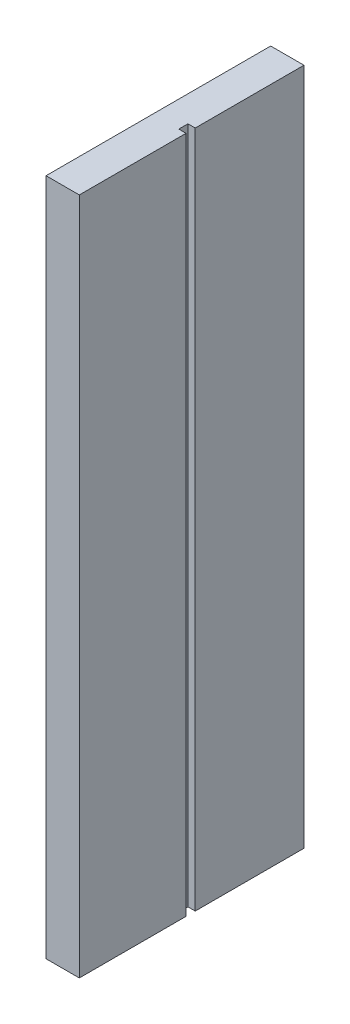
ISO-10303-21;
HEADER;
FILE_DESCRIPTION(('STEP AP214'),'2;1');
FILE_NAME('part.step','',(''),(''),'','','');
FILE_SCHEMA(('AUTOMOTIVE_DESIGN { 1 0 10303 214 1 1 1 1 }'));
ENDSEC;
DATA;
#1=APPLICATION_CONTEXT('core data for automotive mechanical design processes');
#2=APPLICATION_PROTOCOL_DEFINITION('international standard','automotive_design',2000,#1);
#3=PRODUCT_CONTEXT('',#1,'mechanical');
#4=PRODUCT('Part','Part','',(#3));
#5=PRODUCT_RELATED_PRODUCT_CATEGORY('part','',(#4));
#6=PRODUCT_DEFINITION_FORMATION('','',#4);
#7=PRODUCT_DEFINITION_CONTEXT('part definition',#1,'design');
#8=PRODUCT_DEFINITION('design','',#6,#7);
#9=PRODUCT_DEFINITION_SHAPE('','',#8);
#10=(LENGTH_UNIT() NAMED_UNIT(*) SI_UNIT(.MILLI.,.METRE.));
#11=(NAMED_UNIT(*) PLANE_ANGLE_UNIT() SI_UNIT($,.RADIAN.));
#12=(NAMED_UNIT(*) SI_UNIT($,.STERADIAN.) SOLID_ANGLE_UNIT());
#13=UNCERTAINTY_MEASURE_WITH_UNIT(LENGTH_MEASURE(1.E-05),#10,'distance_accuracy_value','');
#14=(GEOMETRIC_REPRESENTATION_CONTEXT(3) GLOBAL_UNCERTAINTY_ASSIGNED_CONTEXT((#13)) GLOBAL_UNIT_ASSIGNED_CONTEXT((#10,
#11,#12)) REPRESENTATION_CONTEXT('',''));
#15=CARTESIAN_POINT('',(0.,0.,0.));
#16=DIRECTION('',(0.,0.,1.));
#17=DIRECTION('',(1.,0.,0.));
#18=AXIS2_PLACEMENT_3D('',#15,#16,#17);
#19=CARTESIAN_POINT('',(0.,-163.,0.));
#20=DIRECTION('',(0.,0.,-1.));
#21=DIRECTION('',(-1.,0.,0.));
#22=AXIS2_PLACEMENT_3D('',#19,#20,#21);
#23=PLANE('',#22);
#24=DIRECTION('',(0.,1.,0.));
#25=VECTOR('',#24,1.);
#26=CARTESIAN_POINT('',(-3.94922764807326,-145.313996313571,0.));
#27=LINE('',#26,#25);
#28=CARTESIAN_POINT('',(-3.94922764807326,-145.313996313571,0.));
#29=VERTEX_POINT('',#28);
#30=CARTESIAN_POINT('',(-3.94922764807326,-140.865918785011,0.));
#31=VERTEX_POINT('',#30);
#32=EDGE_CURVE('E48',#29,#31,#27,.T.);
#33=ORIENTED_EDGE('',*,*,#32,.T.);
#34=DIRECTION('',(1.,0.,0.));
#35=VECTOR('',#34,1.);
#36=CARTESIAN_POINT('',(-8.00000000000001,-140.865918785011,0.));
#37=LINE('',#36,#35);
#38=CARTESIAN_POINT('',(-8.00000000000001,-140.865918785011,0.));
#39=VERTEX_POINT('',#38);
#40=EDGE_CURVE('E186',#39,#31,#37,.T.);
#41=ORIENTED_EDGE('',*,*,#40,.F.);
#42=DIRECTION('',(0.,1.,0.));
#43=VECTOR('',#42,1.);
#44=CARTESIAN_POINT('',(-8.00000000000001,-163.,0.));
#45=LINE('',#44,#43);
#46=CARTESIAN_POINT('',(-8.00000000000001,-91.0881127357461,0.));
#47=VERTEX_POINT('',#46);
#48=EDGE_CURVE('E309',#39,#47,#45,.T.);
#49=ORIENTED_EDGE('',*,*,#48,.T.);
#50=DIRECTION('',(1.,0.,0.));
#51=VECTOR('',#50,1.);
#52=CARTESIAN_POINT('',(-8.00000000000001,-91.0881127357461,0.));
#53=LINE('',#52,#51);
#54=CARTESIAN_POINT('',(-3.55888909966548,-91.0881127357461,0.));
#55=VERTEX_POINT('',#54);
#56=EDGE_CURVE('E209',#47,#55,#53,.T.);
#57=ORIENTED_EDGE('',*,*,#56,.T.);
#58=DIRECTION('',(0.,1.,0.));
#59=VECTOR('',#58,1.);
#60=CARTESIAN_POINT('',(-3.55888909966548,-91.0881127357461,0.));
#61=LINE('',#60,#59);
#62=CARTESIAN_POINT('',(-3.55888909966548,-86.9298687458269,0.));
#63=VERTEX_POINT('',#62);
#64=EDGE_CURVE('E220',#55,#63,#61,.T.);
#65=ORIENTED_EDGE('',*,*,#64,.T.);
#66=DIRECTION('',(1.,0.,0.));
#67=VECTOR('',#66,1.);
#68=CARTESIAN_POINT('',(-8.00000000000001,-86.9298687458269,0.));
#69=LINE('',#68,#67);
#70=CARTESIAN_POINT('',(-8.00000000000001,-86.9298687458269,0.));
#71=VERTEX_POINT('',#70);
#72=EDGE_CURVE('E188',#71,#63,#69,.T.);
#73=ORIENTED_EDGE('',*,*,#72,.F.);
#74=CARTESIAN_POINT('',(-8.00000000000001,-22.9429483674224,0.));
#75=VERTEX_POINT('',#74);
#76=EDGE_CURVE('E356',#71,#75,#45,.T.);
#77=ORIENTED_EDGE('',*,*,#76,.T.);
#78=DIRECTION('',(-1.,0.,0.));
#79=VECTOR('',#78,1.);
#80=CARTESIAN_POINT('',(-8.00000000000001,-22.9429483674224,0.));
#81=LINE('',#80,#79);
#82=CARTESIAN_POINT('',(-3.91515546333565,-22.9429483674224,0.));
#83=VERTEX_POINT('',#82);
#84=EDGE_CURVE('E239',#83,#75,#81,.T.);
#85=ORIENTED_EDGE('',*,*,#84,.F.);
#86=DIRECTION('',(0.,-1.,0.));
#87=VECTOR('',#86,1.);
#88=CARTESIAN_POINT('',(-3.91515546333565,-22.9429483674224,0.));
#89=LINE('',#88,#87);
#90=CARTESIAN_POINT('',(-3.91515546333565,-18.9850937317786,0.));
#91=VERTEX_POINT('',#90);
#92=EDGE_CURVE('E248',#91,#83,#89,.T.);
#93=ORIENTED_EDGE('',*,*,#92,.F.);
#94=DIRECTION('',(1.,0.,0.));
#95=VECTOR('',#94,1.);
#96=CARTESIAN_POINT('',(-8.00000000000001,-18.9850937317786,0.));
#97=LINE('',#96,#95);
#98=CARTESIAN_POINT('',(-8.00000000000001,-18.9850937317786,0.));
#99=VERTEX_POINT('',#98);
#100=EDGE_CURVE('E234',#99,#91,#97,.T.);
#101=ORIENTED_EDGE('',*,*,#100,.F.);
#102=CARTESIAN_POINT('',(-8.00000000000001,0.,0.));
#103=VERTEX_POINT('',#102);
#104=EDGE_CURVE('E305',#99,#103,#45,.T.);
#105=ORIENTED_EDGE('',*,*,#104,.T.);
#106=DIRECTION('',(-1.,0.,0.));
#107=VECTOR('',#106,1.);
#108=CARTESIAN_POINT('',(0.,0.,0.));
#109=LINE('',#108,#107);
#110=CARTESIAN_POINT('',(0.,0.,0.));
#111=VERTEX_POINT('',#110);
#112=EDGE_CURVE('E269',#111,#103,#109,.T.);
#113=ORIENTED_EDGE('',*,*,#112,.F.);
#114=DIRECTION('',(0.,1.,0.));
#115=VECTOR('',#114,1.);
#116=CARTESIAN_POINT('',(0.,-163.,0.));
#117=LINE('',#116,#115);
#118=CARTESIAN_POINT('',(0.,-163.,0.));
#119=VERTEX_POINT('',#118);
#120=EDGE_CURVE('E285',#119,#111,#117,.T.);
#121=ORIENTED_EDGE('',*,*,#120,.F.);
#122=DIRECTION('',(-1.,0.,0.));
#123=VECTOR('',#122,1.);
#124=CARTESIAN_POINT('',(0.,-163.,0.));
#125=LINE('',#124,#123);
#126=CARTESIAN_POINT('',(-8.00000000000001,-163.,0.));
#127=VERTEX_POINT('',#126);
#128=EDGE_CURVE('E282',#119,#127,#125,.T.);
#129=ORIENTED_EDGE('',*,*,#128,.T.);
#130=CARTESIAN_POINT('',(-8.00000000000001,-145.313996313571,0.));
#131=VERTEX_POINT('',#130);
#132=EDGE_CURVE('E306',#127,#131,#45,.T.);
#133=ORIENTED_EDGE('',*,*,#132,.T.);
#134=DIRECTION('',(1.,0.,0.));
#135=VECTOR('',#134,1.);
#136=CARTESIAN_POINT('',(-8.00000000000001,-145.313996313571,0.));
#137=LINE('',#136,#135);
#138=EDGE_CURVE('E53',#131,#29,#137,.T.);
#139=ORIENTED_EDGE('',*,*,#138,.T.);
#140=EDGE_LOOP('',(#33,#41,#49,#57,#65,#73,#77,#85,#93,#101,#105,#113,#121,#129,#133,#139));
#141=FACE_BOUND('',#140,.T.);
#142=ADVANCED_FACE('F33',(#141),#23,.T.);
#143=CARTESIAN_POINT('',(0.,-163.,0.));
#144=DIRECTION('',(-1.,0.,0.));
#145=DIRECTION('',(0.,0.,1.));
#146=AXIS2_PLACEMENT_3D('',#143,#144,#145);
#147=PLANE('',#146);
#148=DIRECTION('',(0.,0.,1.));
#149=VECTOR('',#148,1.);
#150=CARTESIAN_POINT('',(0.,0.,0.));
#151=LINE('',#150,#149);
#152=CARTESIAN_POINT('',(0.,0.,26.1414434986591));
#153=VERTEX_POINT('',#152);
#154=EDGE_CURVE('E264',#111,#153,#151,.T.);
#155=ORIENTED_EDGE('',*,*,#154,.T.);
#156=DIRECTION('',(0.,1.,0.));
#157=VECTOR('',#156,1.);
#158=CARTESIAN_POINT('',(0.,-163.,26.1414434986591));
#159=LINE('',#158,#157);
#160=CARTESIAN_POINT('',(0.,-163.,26.1414434986591));
#161=VERTEX_POINT('',#160);
#162=EDGE_CURVE('E11',#161,#153,#159,.T.);
#163=ORIENTED_EDGE('',*,*,#162,.F.);
#164=DIRECTION('',(0.,0.,1.));
#165=VECTOR('',#164,1.);
#166=CARTESIAN_POINT('',(0.,-163.,0.));
#167=LINE('',#166,#165);
#168=EDGE_CURVE('E265',#119,#161,#167,.T.);
#169=ORIENTED_EDGE('',*,*,#168,.F.);
#170=ORIENTED_EDGE('',*,*,#120,.T.);
#171=EDGE_LOOP('',(#155,#163,#169,#170));
#172=FACE_BOUND('',#171,.T.);
#173=ADVANCED_FACE('F35',(#172),#147,.F.);
#174=CARTESIAN_POINT('',(0.,-163.,26.1414434986591));
#175=DIRECTION('',(0.,0.,-1.));
#176=DIRECTION('',(-1.,0.,0.));
#177=AXIS2_PLACEMENT_3D('',#174,#175,#176);
#178=PLANE('',#177);
#179=DIRECTION('',(-1.,0.,0.));
#180=VECTOR('',#179,1.);
#181=CARTESIAN_POINT('',(0.,0.,26.1414434986591));
#182=LINE('',#181,#180);
#183=CARTESIAN_POINT('',(-1.74869007334344,0.,26.1414434986591));
#184=VERTEX_POINT('',#183);
#185=EDGE_CURVE('E288',#153,#184,#182,.T.);
#186=ORIENTED_EDGE('',*,*,#185,.T.);
#187=DIRECTION('',(0.,1.,0.));
#188=VECTOR('',#187,1.);
#189=CARTESIAN_POINT('',(-1.74869007334344,-163.,26.1414434986591));
#190=LINE('',#189,#188);
#191=CARTESIAN_POINT('',(-1.74869007334344,-163.,26.1414434986591));
#192=VERTEX_POINT('',#191);
#193=EDGE_CURVE('E41',#192,#184,#190,.T.);
#194=ORIENTED_EDGE('',*,*,#193,.F.);
#195=DIRECTION('',(-1.,0.,0.));
#196=VECTOR('',#195,1.);
#197=CARTESIAN_POINT('',(0.,-163.,26.1414434986591));
#198=LINE('',#197,#196);
#199=EDGE_CURVE('E268',#161,#192,#198,.T.);
#200=ORIENTED_EDGE('',*,*,#199,.F.);
#201=ORIENTED_EDGE('',*,*,#162,.T.);
#202=EDGE_LOOP('',(#186,#194,#200,#201));
#203=FACE_BOUND('',#202,.T.);
#204=ADVANCED_FACE('F349',(#203),#178,.F.);
#205=CARTESIAN_POINT('',(-1.74869007334344,-163.,26.1414434986591));
#206=DIRECTION('',(-1.,0.,0.));
#207=DIRECTION('',(0.,0.,1.));
#208=AXIS2_PLACEMENT_3D('',#205,#206,#207);
#209=PLANE('',#208);
#210=DIRECTION('',(0.,0.,1.));
#211=VECTOR('',#210,1.);
#212=CARTESIAN_POINT('',(-1.74869007334344,0.,26.1414434986591));
#213=LINE('',#212,#211);
#214=CARTESIAN_POINT('',(-1.74869007334344,0.,28.3423878615849));
#215=VERTEX_POINT('',#214);
#216=EDGE_CURVE('E290',#184,#215,#213,.T.);
#217=ORIENTED_EDGE('',*,*,#216,.T.);
#218=DIRECTION('',(0.,1.,0.));
#219=VECTOR('',#218,1.);
#220=CARTESIAN_POINT('',(-1.74869007334344,-163.,28.3423878615849));
#221=LINE('',#220,#219);
#222=CARTESIAN_POINT('',(-1.74869007334344,-163.,28.3423878615849));
#223=VERTEX_POINT('',#222);
#224=EDGE_CURVE('E317',#223,#215,#221,.T.);
#225=ORIENTED_EDGE('',*,*,#224,.F.);
#226=DIRECTION('',(0.,0.,1.));
#227=VECTOR('',#226,1.);
#228=CARTESIAN_POINT('',(-1.74869007334344,-163.,26.1414434986591));
#229=LINE('',#228,#227);
#230=EDGE_CURVE('E271',#192,#223,#229,.T.);
#231=ORIENTED_EDGE('',*,*,#230,.F.);
#232=ORIENTED_EDGE('',*,*,#193,.T.);
#233=EDGE_LOOP('',(#217,#225,#231,#232));
#234=FACE_BOUND('',#233,.T.);
#235=ADVANCED_FACE('F324',(#234),#209,.F.);
#236=CARTESIAN_POINT('',(-1.74869007334344,-163.,28.3423878615849));
#237=DIRECTION('',(0.,0.,1.));
#238=DIRECTION('',(1.,0.,0.));
#239=AXIS2_PLACEMENT_3D('',#236,#237,#238);
#240=PLANE('',#239);
#241=DIRECTION('',(1.,0.,0.));
#242=VECTOR('',#241,1.);
#243=CARTESIAN_POINT('',(-1.74869007334344,0.,28.3423878615849));
#244=LINE('',#243,#242);
#245=CARTESIAN_POINT('',(0.,0.,28.3423878615849));
#246=VERTEX_POINT('',#245);
#247=EDGE_CURVE('E292',#215,#246,#244,.T.);
#248=ORIENTED_EDGE('',*,*,#247,.T.);
#249=DIRECTION('',(0.,1.,0.));
#250=VECTOR('',#249,1.);
#251=CARTESIAN_POINT('',(0.,-163.,28.3423878615849));
#252=LINE('',#251,#250);
#253=CARTESIAN_POINT('',(0.,-163.,28.3423878615849));
#254=VERTEX_POINT('',#253);
#255=EDGE_CURVE('E314',#254,#246,#252,.T.);
#256=ORIENTED_EDGE('',*,*,#255,.F.);
#257=DIRECTION('',(1.,0.,0.));
#258=VECTOR('',#257,1.);
#259=CARTESIAN_POINT('',(-1.74869007334344,-163.,28.3423878615849));
#260=LINE('',#259,#258);
#261=EDGE_CURVE('E273',#223,#254,#260,.T.);
#262=ORIENTED_EDGE('',*,*,#261,.F.);
#263=ORIENTED_EDGE('',*,*,#224,.T.);
#264=EDGE_LOOP('',(#248,#256,#262,#263));
#265=FACE_BOUND('',#264,.T.);
#266=ADVANCED_FACE('F335',(#265),#240,.F.);
#267=CARTESIAN_POINT('',(0.,-163.,28.3423878615849));
#268=DIRECTION('',(-1.,0.,0.));
#269=DIRECTION('',(0.,0.,1.));
#270=AXIS2_PLACEMENT_3D('',#267,#268,#269);
#271=PLANE('',#270);
#272=DIRECTION('',(0.,0.,1.));
#273=VECTOR('',#272,1.);
#274=CARTESIAN_POINT('',(0.,0.,28.3423878615849));
#275=LINE('',#274,#273);
#276=CARTESIAN_POINT('',(0.,0.,54.));
#277=VERTEX_POINT('',#276);
#278=EDGE_CURVE('E294',#246,#277,#275,.T.);
#279=ORIENTED_EDGE('',*,*,#278,.T.);
#280=DIRECTION('',(0.,1.,0.));
#281=VECTOR('',#280,1.);
#282=CARTESIAN_POINT('',(0.,-163.,54.));
#283=LINE('',#282,#281);
#284=CARTESIAN_POINT('',(0.,-163.,54.));
#285=VERTEX_POINT('',#284);
#286=EDGE_CURVE('E311',#285,#277,#283,.T.);
#287=ORIENTED_EDGE('',*,*,#286,.F.);
#288=DIRECTION('',(0.,0.,1.));
#289=VECTOR('',#288,1.);
#290=CARTESIAN_POINT('',(0.,-163.,28.3423878615849));
#291=LINE('',#290,#289);
#292=EDGE_CURVE('E275',#254,#285,#291,.T.);
#293=ORIENTED_EDGE('',*,*,#292,.F.);
#294=ORIENTED_EDGE('',*,*,#255,.T.);
#295=EDGE_LOOP('',(#279,#287,#293,#294));
#296=FACE_BOUND('',#295,.T.);
#297=ADVANCED_FACE('F339',(#296),#271,.F.);
#298=CARTESIAN_POINT('',(0.,-163.,54.));
#299=DIRECTION('',(0.,0.,-1.));
#300=DIRECTION('',(-1.,0.,0.));
#301=AXIS2_PLACEMENT_3D('',#298,#299,#300);
#302=PLANE('',#301);
#303=DIRECTION('',(-1.,0.,0.));
#304=VECTOR('',#303,1.);
#305=CARTESIAN_POINT('',(0.,0.,54.));
#306=LINE('',#305,#304);
#307=CARTESIAN_POINT('',(-8.00000000000001,0.,54.));
#308=VERTEX_POINT('',#307);
#309=EDGE_CURVE('E296',#277,#308,#306,.T.);
#310=ORIENTED_EDGE('',*,*,#309,.T.);
#311=DIRECTION('',(0.,1.,0.));
#312=VECTOR('',#311,1.);
#313=CARTESIAN_POINT('',(-8.00000000000001,-163.,54.));
#314=LINE('',#313,#312);
#315=CARTESIAN_POINT('',(-8.00000000000001,-163.,54.));
#316=VERTEX_POINT('',#315);
#317=EDGE_CURVE('E308',#316,#308,#314,.T.);
#318=ORIENTED_EDGE('',*,*,#317,.F.);
#319=DIRECTION('',(-1.,0.,0.));
#320=VECTOR('',#319,1.);
#321=CARTESIAN_POINT('',(0.,-163.,54.));
#322=LINE('',#321,#320);
#323=EDGE_CURVE('E277',#285,#316,#322,.T.);
#324=ORIENTED_EDGE('',*,*,#323,.F.);
#325=ORIENTED_EDGE('',*,*,#286,.T.);
#326=EDGE_LOOP('',(#310,#318,#324,#325));
#327=FACE_BOUND('',#326,.T.);
#328=ADVANCED_FACE('F359',(#327),#302,.F.);
#329=CARTESIAN_POINT('',(-8.00000000000001,-163.,0.));
#330=DIRECTION('',(-1.,0.,0.));
#331=DIRECTION('',(0.,0.,1.));
#332=AXIS2_PLACEMENT_3D('',#329,#330,#331);
#333=PLANE('',#332);
#334=DIRECTION('',(0.,0.,1.));
#335=VECTOR('',#334,1.);
#336=CARTESIAN_POINT('',(-8.00000000000001,0.,0.));
#337=LINE('',#336,#335);
#338=EDGE_CURVE('E299',#103,#308,#337,.T.);
#339=ORIENTED_EDGE('',*,*,#338,.F.);
#340=ORIENTED_EDGE('',*,*,#104,.F.);
#341=DIRECTION('',(0.,0.,1.));
#342=VECTOR('',#341,1.);
#343=CARTESIAN_POINT('',(-8.00000000000001,-18.9850937317786,-2.));
#344=LINE('',#343,#342);
#345=CARTESIAN_POINT('',(-8.00000000000001,-18.9850937317786,-2.));
#346=VERTEX_POINT('',#345);
#347=EDGE_CURVE('E261',#346,#99,#344,.T.);
#348=ORIENTED_EDGE('',*,*,#347,.F.);
#349=DIRECTION('',(0.,1.,0.));
#350=VECTOR('',#349,1.);
#351=CARTESIAN_POINT('',(-8.00000000000001,-22.9429483674224,-2.));
#352=LINE('',#351,#350);
#353=CARTESIAN_POINT('',(-8.00000000000001,-22.9429483674224,-2.));
#354=VERTEX_POINT('',#353);
#355=EDGE_CURVE('E235',#354,#346,#352,.T.);
#356=ORIENTED_EDGE('',*,*,#355,.F.);
#357=DIRECTION('',(0.,0.,1.));
#358=VECTOR('',#357,1.);
#359=CARTESIAN_POINT('',(-8.00000000000001,-22.9429483674224,-2.));
#360=LINE('',#359,#358);
#361=EDGE_CURVE('E245',#354,#75,#360,.T.);
#362=ORIENTED_EDGE('',*,*,#361,.T.);
#363=ORIENTED_EDGE('',*,*,#76,.F.);
#364=DIRECTION('',(0.,0.,1.));
#365=VECTOR('',#364,1.);
#366=CARTESIAN_POINT('',(-8.00000000000001,-86.9298687458269,-2.));
#367=LINE('',#366,#365);
#368=CARTESIAN_POINT('',(-8.00000000000001,-86.9298687458269,-2.));
#369=VERTEX_POINT('',#368);
#370=EDGE_CURVE('E217',#369,#71,#367,.T.);
#371=ORIENTED_EDGE('',*,*,#370,.F.);
#372=DIRECTION('',(0.,1.,0.));
#373=VECTOR('',#372,1.);
#374=CARTESIAN_POINT('',(-8.00000000000001,-91.0881127357461,-2.));
#375=LINE('',#374,#373);
#376=CARTESIAN_POINT('',(-8.00000000000001,-91.0881127357461,-2.));
#377=VERTEX_POINT('',#376);
#378=EDGE_CURVE('E215',#377,#369,#375,.T.);
#379=ORIENTED_EDGE('',*,*,#378,.F.);
#380=DIRECTION('',(0.,0.,1.));
#381=VECTOR('',#380,1.);
#382=CARTESIAN_POINT('',(-8.00000000000001,-91.0881127357461,-2.));
#383=LINE('',#382,#381);
#384=EDGE_CURVE('E225',#377,#47,#383,.T.);
#385=ORIENTED_EDGE('',*,*,#384,.T.);
#386=ORIENTED_EDGE('',*,*,#48,.F.);
#387=DIRECTION('',(0.,0.,1.));
#388=VECTOR('',#387,1.);
#389=CARTESIAN_POINT('',(-8.00000000000001,-140.865918785011,-2.));
#390=LINE('',#389,#388);
#391=CARTESIAN_POINT('',(-8.00000000000001,-140.865918785011,-2.));
#392=VERTEX_POINT('',#391);
#393=EDGE_CURVE('E197',#392,#39,#390,.T.);
#394=ORIENTED_EDGE('',*,*,#393,.F.);
#395=DIRECTION('',(0.,1.,0.));
#396=VECTOR('',#395,1.);
#397=CARTESIAN_POINT('',(-8.00000000000001,-145.313996313571,-2.));
#398=LINE('',#397,#396);
#399=CARTESIAN_POINT('',(-8.00000000000001,-145.313996313571,-2.));
#400=VERTEX_POINT('',#399);
#401=EDGE_CURVE('E178',#400,#392,#398,.T.);
#402=ORIENTED_EDGE('',*,*,#401,.F.);
#403=DIRECTION('',(0.,0.,1.));
#404=VECTOR('',#403,1.);
#405=CARTESIAN_POINT('',(-8.00000000000001,-145.313996313571,-2.));
#406=LINE('',#405,#404);
#407=EDGE_CURVE('E202',#400,#131,#406,.T.);
#408=ORIENTED_EDGE('',*,*,#407,.T.);
#409=ORIENTED_EDGE('',*,*,#132,.F.);
#410=DIRECTION('',(0.,0.,1.));
#411=VECTOR('',#410,1.);
#412=CARTESIAN_POINT('',(-8.00000000000001,-163.,0.));
#413=LINE('',#412,#411);
#414=EDGE_CURVE('E279',#127,#316,#413,.T.);
#415=ORIENTED_EDGE('',*,*,#414,.T.);
#416=ORIENTED_EDGE('',*,*,#317,.T.);
#417=EDGE_LOOP('',(#339,#340,#348,#356,#362,#363,#371,#379,#385,#386,#394,#402,#408,#409,#415,#416));
#418=FACE_BOUND('',#417,.T.);
#419=ADVANCED_FACE('F357',(#418),#333,.T.);
#420=CARTESIAN_POINT('',(0.,-163.,0.));
#421=DIRECTION('',(0.,-1.,0.));
#422=DIRECTION('',(0.,0.,-1.));
#423=AXIS2_PLACEMENT_3D('',#420,#421,#422);
#424=PLANE('',#423);
#425=ORIENTED_EDGE('',*,*,#168,.T.);
#426=ORIENTED_EDGE('',*,*,#199,.T.);
#427=ORIENTED_EDGE('',*,*,#230,.T.);
#428=ORIENTED_EDGE('',*,*,#261,.T.);
#429=ORIENTED_EDGE('',*,*,#292,.T.);
#430=ORIENTED_EDGE('',*,*,#323,.T.);
#431=ORIENTED_EDGE('',*,*,#414,.F.);
#432=ORIENTED_EDGE('',*,*,#128,.F.);
#433=EDGE_LOOP('',(#425,#426,#427,#428,#429,#430,#431,#432));
#434=FACE_BOUND('',#433,.T.);
#435=ADVANCED_FACE('F343',(#434),#424,.T.);
#436=CARTESIAN_POINT('',(0.,0.,0.));
#437=DIRECTION('',(0.,-1.,0.));
#438=DIRECTION('',(0.,0.,-1.));
#439=AXIS2_PLACEMENT_3D('',#436,#437,#438);
#440=PLANE('',#439);
#441=ORIENTED_EDGE('',*,*,#154,.F.);
#442=ORIENTED_EDGE('',*,*,#112,.T.);
#443=ORIENTED_EDGE('',*,*,#338,.T.);
#444=ORIENTED_EDGE('',*,*,#309,.F.);
#445=ORIENTED_EDGE('',*,*,#278,.F.);
#446=ORIENTED_EDGE('',*,*,#247,.F.);
#447=ORIENTED_EDGE('',*,*,#216,.F.);
#448=ORIENTED_EDGE('',*,*,#185,.F.);
#449=EDGE_LOOP('',(#441,#442,#443,#444,#445,#446,#447,#448));
#450=FACE_BOUND('',#449,.T.);
#451=ADVANCED_FACE('F330',(#450),#440,.F.);
#452=CARTESIAN_POINT('',(-8.00000000000001,-18.9850937317786,-2.));
#453=DIRECTION('',(0.,-1.,0.));
#454=DIRECTION('',(0.,0.,-1.));
#455=AXIS2_PLACEMENT_3D('',#452,#453,#454);
#456=PLANE('',#455);
#457=ORIENTED_EDGE('',*,*,#100,.T.);
#458=DIRECTION('',(0.,0.,1.));
#459=VECTOR('',#458,1.);
#460=CARTESIAN_POINT('',(-3.91515546333565,-18.9850937317786,-2.));
#461=LINE('',#460,#459);
#462=CARTESIAN_POINT('',(-3.91515546333565,-18.9850937317786,-2.));
#463=VERTEX_POINT('',#462);
#464=EDGE_CURVE('E258',#463,#91,#461,.T.);
#465=ORIENTED_EDGE('',*,*,#464,.F.);
#466=DIRECTION('',(1.,0.,0.));
#467=VECTOR('',#466,1.);
#468=CARTESIAN_POINT('',(-8.00000000000001,-18.9850937317786,-2.));
#469=LINE('',#468,#467);
#470=EDGE_CURVE('E238',#346,#463,#469,.T.);
#471=ORIENTED_EDGE('',*,*,#470,.F.);
#472=ORIENTED_EDGE('',*,*,#347,.T.);
#473=EDGE_LOOP('',(#457,#465,#471,#472));
#474=FACE_BOUND('',#473,.T.);
#475=ADVANCED_FACE('F424',(#474),#456,.F.);
#476=CARTESIAN_POINT('',(-3.91515546333565,-22.9429483674224,-2.));
#477=DIRECTION('',(-1.,0.,0.));
#478=DIRECTION('',(0.,0.,1.));
#479=AXIS2_PLACEMENT_3D('',#476,#477,#478);
#480=PLANE('',#479);
#481=ORIENTED_EDGE('',*,*,#92,.T.);
#482=DIRECTION('',(0.,0.,1.));
#483=VECTOR('',#482,1.);
#484=CARTESIAN_POINT('',(-3.91515546333565,-22.9429483674224,-2.));
#485=LINE('',#484,#483);
#486=CARTESIAN_POINT('',(-3.91515546333565,-22.9429483674224,-2.));
#487=VERTEX_POINT('',#486);
#488=EDGE_CURVE('E255',#487,#83,#485,.T.);
#489=ORIENTED_EDGE('',*,*,#488,.F.);
#490=DIRECTION('',(0.,-1.,0.));
#491=VECTOR('',#490,1.);
#492=CARTESIAN_POINT('',(-3.91515546333565,-22.9429483674224,-2.));
#493=LINE('',#492,#491);
#494=EDGE_CURVE('E241',#463,#487,#493,.T.);
#495=ORIENTED_EDGE('',*,*,#494,.F.);
#496=ORIENTED_EDGE('',*,*,#464,.T.);
#497=EDGE_LOOP('',(#481,#489,#495,#496));
#498=FACE_BOUND('',#497,.T.);
#499=ADVANCED_FACE('F430',(#498),#480,.F.);
#500=CARTESIAN_POINT('',(-8.00000000000001,-22.9429483674224,-2.));
#501=DIRECTION('',(0.,1.,0.));
#502=DIRECTION('',(0.,0.,1.));
#503=AXIS2_PLACEMENT_3D('',#500,#501,#502);
#504=PLANE('',#503);
#505=ORIENTED_EDGE('',*,*,#84,.T.);
#506=ORIENTED_EDGE('',*,*,#361,.F.);
#507=DIRECTION('',(-1.,0.,0.));
#508=VECTOR('',#507,1.);
#509=CARTESIAN_POINT('',(-8.00000000000001,-22.9429483674224,-2.));
#510=LINE('',#509,#508);
#511=EDGE_CURVE('E243',#487,#354,#510,.T.);
#512=ORIENTED_EDGE('',*,*,#511,.F.);
#513=ORIENTED_EDGE('',*,*,#488,.T.);
#514=EDGE_LOOP('',(#505,#506,#512,#513));
#515=FACE_BOUND('',#514,.T.);
#516=ADVANCED_FACE('F438',(#515),#504,.F.);
#517=CARTESIAN_POINT('',(0.,0.,-2.));
#518=DIRECTION('',(0.,0.,-1.));
#519=DIRECTION('',(-1.,0.,0.));
#520=AXIS2_PLACEMENT_3D('',#517,#518,#519);
#521=PLANE('',#520);
#522=ORIENTED_EDGE('',*,*,#355,.T.);
#523=ORIENTED_EDGE('',*,*,#470,.T.);
#524=ORIENTED_EDGE('',*,*,#494,.T.);
#525=ORIENTED_EDGE('',*,*,#511,.T.);
#526=EDGE_LOOP('',(#522,#523,#524,#525));
#527=FACE_BOUND('',#526,.T.);
#528=ADVANCED_FACE('F446',(#527),#521,.T.);
#529=CARTESIAN_POINT('',(-8.00000000000001,-86.9298687458269,-2.));
#530=DIRECTION('',(0.,-1.,0.));
#531=DIRECTION('',(0.,0.,-1.));
#532=AXIS2_PLACEMENT_3D('',#529,#530,#531);
#533=PLANE('',#532);
#534=ORIENTED_EDGE('',*,*,#72,.T.);
#535=DIRECTION('',(0.,0.,1.));
#536=VECTOR('',#535,1.);
#537=CARTESIAN_POINT('',(-3.55888909966548,-86.9298687458269,-2.));
#538=LINE('',#537,#536);
#539=CARTESIAN_POINT('',(-3.55888909966548,-86.9298687458269,-2.));
#540=VERTEX_POINT('',#539);
#541=EDGE_CURVE('E231',#540,#63,#538,.T.);
#542=ORIENTED_EDGE('',*,*,#541,.F.);
#543=DIRECTION('',(1.,0.,0.));
#544=VECTOR('',#543,1.);
#545=CARTESIAN_POINT('',(-8.00000000000001,-86.9298687458269,-2.));
#546=LINE('',#545,#544);
#547=EDGE_CURVE('E206',#369,#540,#546,.T.);
#548=ORIENTED_EDGE('',*,*,#547,.F.);
#549=ORIENTED_EDGE('',*,*,#370,.T.);
#550=EDGE_LOOP('',(#534,#542,#548,#549));
#551=FACE_BOUND('',#550,.T.);
#552=ADVANCED_FACE('F454',(#551),#533,.F.);
#553=CARTESIAN_POINT('',(-3.55888909966548,-91.0881127357461,-2.));
#554=DIRECTION('',(1.,0.,0.));
#555=DIRECTION('',(0.,0.,-1.));
#556=AXIS2_PLACEMENT_3D('',#553,#554,#555);
#557=PLANE('',#556);
#558=ORIENTED_EDGE('',*,*,#64,.F.);
#559=DIRECTION('',(0.,0.,1.));
#560=VECTOR('',#559,1.);
#561=CARTESIAN_POINT('',(-3.55888909966548,-91.0881127357461,-2.));
#562=LINE('',#561,#560);
#563=CARTESIAN_POINT('',(-3.55888909966548,-91.0881127357461,-2.));
#564=VERTEX_POINT('',#563);
#565=EDGE_CURVE('E228',#564,#55,#562,.T.);
#566=ORIENTED_EDGE('',*,*,#565,.F.);
#567=DIRECTION('',(0.,1.,0.));
#568=VECTOR('',#567,1.);
#569=CARTESIAN_POINT('',(-3.55888909966548,-91.0881127357461,-2.));
#570=LINE('',#569,#568);
#571=EDGE_CURVE('E208',#564,#540,#570,.T.);
#572=ORIENTED_EDGE('',*,*,#571,.T.);
#573=ORIENTED_EDGE('',*,*,#541,.T.);
#574=EDGE_LOOP('',(#558,#566,#572,#573));
#575=FACE_BOUND('',#574,.T.);
#576=ADVANCED_FACE('F462',(#575),#557,.T.);
#577=CARTESIAN_POINT('',(-8.00000000000001,-91.0881127357461,-2.));
#578=DIRECTION('',(0.,-1.,0.));
#579=DIRECTION('',(0.,0.,-1.));
#580=AXIS2_PLACEMENT_3D('',#577,#578,#579);
#581=PLANE('',#580);
#582=ORIENTED_EDGE('',*,*,#56,.F.);
#583=ORIENTED_EDGE('',*,*,#384,.F.);
#584=DIRECTION('',(1.,0.,0.));
#585=VECTOR('',#584,1.);
#586=CARTESIAN_POINT('',(-8.00000000000001,-91.0881127357461,-2.));
#587=LINE('',#586,#585);
#588=EDGE_CURVE('E212',#377,#564,#587,.T.);
#589=ORIENTED_EDGE('',*,*,#588,.T.);
#590=ORIENTED_EDGE('',*,*,#565,.T.);
#591=EDGE_LOOP('',(#582,#583,#589,#590));
#592=FACE_BOUND('',#591,.T.);
#593=ADVANCED_FACE('F470',(#592),#581,.T.);
#594=CARTESIAN_POINT('',(0.,0.,-2.));
#595=DIRECTION('',(0.,0.,1.));
#596=DIRECTION('',(1.,0.,0.));
#597=AXIS2_PLACEMENT_3D('',#594,#595,#596);
#598=PLANE('',#597);
#599=ORIENTED_EDGE('',*,*,#547,.T.);
#600=ORIENTED_EDGE('',*,*,#571,.F.);
#601=ORIENTED_EDGE('',*,*,#588,.F.);
#602=ORIENTED_EDGE('',*,*,#378,.T.);
#603=EDGE_LOOP('',(#599,#600,#601,#602));
#604=FACE_BOUND('',#603,.T.);
#605=ADVANCED_FACE('F478',(#604),#598,.F.);
#606=CARTESIAN_POINT('',(-8.00000000000001,-140.865918785011,-2.));
#607=DIRECTION('',(0.,-1.,0.));
#608=DIRECTION('',(0.,0.,-1.));
#609=AXIS2_PLACEMENT_3D('',#606,#607,#608);
#610=PLANE('',#609);
#611=ORIENTED_EDGE('',*,*,#40,.T.);
#612=DIRECTION('',(0.,0.,1.));
#613=VECTOR('',#612,1.);
#614=CARTESIAN_POINT('',(-3.94922764807326,-140.865918785011,-2.));
#615=LINE('',#614,#613);
#616=CARTESIAN_POINT('',(-3.94922764807326,-140.865918785011,-2.));
#617=VERTEX_POINT('',#616);
#618=EDGE_CURVE('E184',#617,#31,#615,.T.);
#619=ORIENTED_EDGE('',*,*,#618,.F.);
#620=DIRECTION('',(1.,0.,0.));
#621=VECTOR('',#620,1.);
#622=CARTESIAN_POINT('',(-8.00000000000001,-140.865918785011,-2.));
#623=LINE('',#622,#621);
#624=EDGE_CURVE('E170',#392,#617,#623,.T.);
#625=ORIENTED_EDGE('',*,*,#624,.F.);
#626=ORIENTED_EDGE('',*,*,#393,.T.);
#627=EDGE_LOOP('',(#611,#619,#625,#626));
#628=FACE_BOUND('',#627,.T.);
#629=ADVANCED_FACE('F185',(#628),#610,.F.);
#630=CARTESIAN_POINT('',(-3.94922764807326,-145.313996313571,-2.));
#631=DIRECTION('',(1.,0.,0.));
#632=DIRECTION('',(0.,0.,-1.));
#633=AXIS2_PLACEMENT_3D('',#630,#631,#632);
#634=PLANE('',#633);
#635=ORIENTED_EDGE('',*,*,#32,.F.);
#636=DIRECTION('',(0.,0.,1.));
#637=VECTOR('',#636,1.);
#638=CARTESIAN_POINT('',(-3.94922764807326,-145.313996313571,-2.));
#639=LINE('',#638,#637);
#640=CARTESIAN_POINT('',(-3.94922764807326,-145.313996313571,-2.));
#641=VERTEX_POINT('',#640);
#642=EDGE_CURVE('E189',#641,#29,#639,.T.);
#643=ORIENTED_EDGE('',*,*,#642,.F.);
#644=DIRECTION('',(0.,1.,0.));
#645=VECTOR('',#644,1.);
#646=CARTESIAN_POINT('',(-3.94922764807326,-145.313996313571,-2.));
#647=LINE('',#646,#645);
#648=EDGE_CURVE('E175',#641,#617,#647,.T.);
#649=ORIENTED_EDGE('',*,*,#648,.T.);
#650=ORIENTED_EDGE('',*,*,#618,.T.);
#651=EDGE_LOOP('',(#635,#643,#649,#650));
#652=FACE_BOUND('',#651,.T.);
#653=ADVANCED_FACE('F191',(#652),#634,.T.);
#654=CARTESIAN_POINT('',(-8.00000000000001,-145.313996313571,-2.));
#655=DIRECTION('',(0.,-1.,0.));
#656=DIRECTION('',(0.,0.,-1.));
#657=AXIS2_PLACEMENT_3D('',#654,#655,#656);
#658=PLANE('',#657);
#659=ORIENTED_EDGE('',*,*,#138,.F.);
#660=ORIENTED_EDGE('',*,*,#407,.F.);
#661=DIRECTION('',(1.,0.,0.));
#662=VECTOR('',#661,1.);
#663=CARTESIAN_POINT('',(-8.00000000000001,-145.313996313571,-2.));
#664=LINE('',#663,#662);
#665=EDGE_CURVE('E192',#400,#641,#664,.T.);
#666=ORIENTED_EDGE('',*,*,#665,.T.);
#667=ORIENTED_EDGE('',*,*,#642,.T.);
#668=EDGE_LOOP('',(#659,#660,#666,#667));
#669=FACE_BOUND('',#668,.T.);
#670=ADVANCED_FACE('F361',(#669),#658,.T.);
#671=CARTESIAN_POINT('',(0.,0.,-2.));
#672=DIRECTION('',(0.,0.,1.));
#673=DIRECTION('',(1.,0.,0.));
#674=AXIS2_PLACEMENT_3D('',#671,#672,#673);
#675=PLANE('',#674);
#676=ORIENTED_EDGE('',*,*,#624,.T.);
#677=ORIENTED_EDGE('',*,*,#648,.F.);
#678=ORIENTED_EDGE('',*,*,#665,.F.);
#679=ORIENTED_EDGE('',*,*,#401,.T.);
#680=EDGE_LOOP('',(#676,#677,#678,#679));
#681=FACE_BOUND('',#680,.T.);
#682=ADVANCED_FACE('F172',(#681),#675,.F.);
#683=CLOSED_SHELL('',(#142,#173,#204,#235,#266,#297,#328,#419,#435,#451,#475,#499,#516,#528,
#552,#576,#593,#605,#629,#653,#670,#682));
#684=MANIFOLD_SOLID_BREP('B2',#683);
#685=ADVANCED_BREP_SHAPE_REPRESENTATION('',(#18,#684),#14);
#686=SHAPE_DEFINITION_REPRESENTATION(#9,#685);
ENDSEC;
END-ISO-10303-21;
